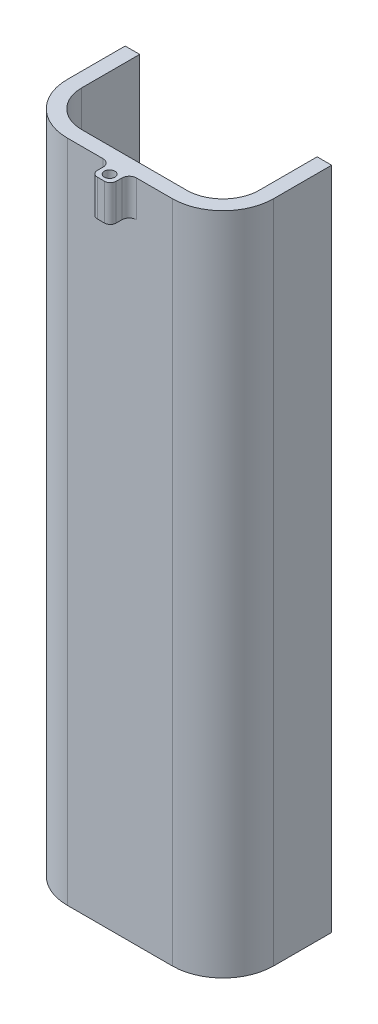
ISO-10303-21;
HEADER;
FILE_DESCRIPTION(('STEP AP214'),'2;1');
FILE_NAME('part.step','',(''),(''),'','','');
FILE_SCHEMA(('AUTOMOTIVE_DESIGN { 1 0 10303 214 1 1 1 1 }'));
ENDSEC;
DATA;
#1=APPLICATION_CONTEXT('core data for automotive mechanical design processes');
#2=APPLICATION_PROTOCOL_DEFINITION('international standard','automotive_design',2000,#1);
#3=PRODUCT_CONTEXT('',#1,'mechanical');
#4=PRODUCT('Part','Part','',(#3));
#5=PRODUCT_RELATED_PRODUCT_CATEGORY('part','',(#4));
#6=PRODUCT_DEFINITION_FORMATION('','',#4);
#7=PRODUCT_DEFINITION_CONTEXT('part definition',#1,'design');
#8=PRODUCT_DEFINITION('design','',#6,#7);
#9=PRODUCT_DEFINITION_SHAPE('','',#8);
#10=(LENGTH_UNIT() NAMED_UNIT(*) SI_UNIT(.MILLI.,.METRE.));
#11=(NAMED_UNIT(*) PLANE_ANGLE_UNIT() SI_UNIT($,.RADIAN.));
#12=(NAMED_UNIT(*) SI_UNIT($,.STERADIAN.) SOLID_ANGLE_UNIT());
#13=UNCERTAINTY_MEASURE_WITH_UNIT(LENGTH_MEASURE(1.E-05),#10,'distance_accuracy_value','');
#14=(GEOMETRIC_REPRESENTATION_CONTEXT(3) GLOBAL_UNCERTAINTY_ASSIGNED_CONTEXT((#13)) GLOBAL_UNIT_ASSIGNED_CONTEXT((#10,
#11,#12)) REPRESENTATION_CONTEXT('',''));
#15=CARTESIAN_POINT('',(0.,0.,0.));
#16=DIRECTION('',(0.,0.,1.));
#17=DIRECTION('',(1.,0.,0.));
#18=AXIS2_PLACEMENT_3D('',#15,#16,#17);
#19=CARTESIAN_POINT('',(0.,110.,228.149030702734));
#20=DIRECTION('',(0.,1.,0.));
#21=DIRECTION('',(0.,0.,1.));
#22=AXIS2_PLACEMENT_3D('',#19,#20,#21);
#23=PLANE('',#22);
#24=DIRECTION('',(1.,0.,0.));
#25=VECTOR('',#24,1.);
#26=CARTESIAN_POINT('',(0.,110.,0.));
#27=LINE('',#26,#25);
#28=CARTESIAN_POINT('',(24.5,110.,0.));
#29=VERTEX_POINT('',#28);
#30=CARTESIAN_POINT('',(28.5,110.,0.));
#31=VERTEX_POINT('',#30);
#32=EDGE_CURVE('E304',#29,#31,#27,.T.);
#33=ORIENTED_EDGE('',*,*,#32,.F.);
#34=DIRECTION('',(0.,0.,-1.));
#35=VECTOR('',#34,1.);
#36=CARTESIAN_POINT('',(24.5,110.,0.));
#37=LINE('',#36,#35);
#38=CARTESIAN_POINT('',(24.5,110.,16.));
#39=VERTEX_POINT('',#38);
#40=EDGE_CURVE('E246',#39,#29,#37,.T.);
#41=ORIENTED_EDGE('',*,*,#40,.F.);
#42=CARTESIAN_POINT('',(14.5,110.,16.));
#43=DIRECTION('',(0.,1.,0.));
#44=DIRECTION('',(0.,0.,1.));
#45=AXIS2_PLACEMENT_3D('',#42,#43,#44);
#46=CIRCLE('',#45,10.);
#47=CARTESIAN_POINT('',(14.5,110.,26.));
#48=VERTEX_POINT('',#47);
#49=EDGE_CURVE('E250',#39,#48,#46,.F.);
#50=ORIENTED_EDGE('',*,*,#49,.T.);
#51=DIRECTION('',(-1.,0.,0.));
#52=VECTOR('',#51,1.);
#53=CARTESIAN_POINT('',(0.,110.,26.));
#54=LINE('',#53,#52);
#55=CARTESIAN_POINT('',(-14.5,110.,26.));
#56=VERTEX_POINT('',#55);
#57=EDGE_CURVE('E253',#48,#56,#54,.T.);
#58=ORIENTED_EDGE('',*,*,#57,.T.);
#59=CARTESIAN_POINT('',(-14.5,110.,16.));
#60=DIRECTION('',(0.,1.,0.));
#61=DIRECTION('',(0.,0.,1.));
#62=AXIS2_PLACEMENT_3D('',#59,#60,#61);
#63=CIRCLE('',#62,10.);
#64=CARTESIAN_POINT('',(-24.5,110.,16.));
#65=VERTEX_POINT('',#64);
#66=EDGE_CURVE('E235',#56,#65,#63,.F.);
#67=ORIENTED_EDGE('',*,*,#66,.T.);
#68=DIRECTION('',(0.,0.,1.));
#69=VECTOR('',#68,1.);
#70=CARTESIAN_POINT('',(-24.5,110.,0.));
#71=LINE('',#70,#69);
#72=CARTESIAN_POINT('',(-24.5,110.,0.));
#73=VERTEX_POINT('',#72);
#74=EDGE_CURVE('E249',#73,#65,#71,.T.);
#75=ORIENTED_EDGE('',*,*,#74,.F.);
#76=CARTESIAN_POINT('',(-28.5,110.,0.));
#77=VERTEX_POINT('',#76);
#78=EDGE_CURVE('E291',#77,#73,#27,.T.);
#79=ORIENTED_EDGE('',*,*,#78,.F.);
#80=DIRECTION('',(0.,0.,-1.));
#81=VECTOR('',#80,1.);
#82=CARTESIAN_POINT('',(-28.5,110.,228.149030702734));
#83=LINE('',#82,#81);
#84=CARTESIAN_POINT('',(-28.5,110.,16.));
#85=VERTEX_POINT('',#84);
#86=EDGE_CURVE('E301',#85,#77,#83,.T.);
#87=ORIENTED_EDGE('',*,*,#86,.F.);
#88=CARTESIAN_POINT('',(-14.5,110.,16.));
#89=DIRECTION('',(0.,1.,0.));
#90=DIRECTION('',(0.,0.,1.));
#91=AXIS2_PLACEMENT_3D('',#88,#89,#90);
#92=CIRCLE('',#91,14.);
#93=CARTESIAN_POINT('',(-14.5,110.,30.));
#94=VERTEX_POINT('',#93);
#95=EDGE_CURVE('E323',#85,#94,#92,.T.);
#96=ORIENTED_EDGE('',*,*,#95,.T.);
#97=DIRECTION('',(-1.,0.,0.));
#98=VECTOR('',#97,1.);
#99=CARTESIAN_POINT('',(0.,110.,30.));
#100=LINE('',#99,#98);
#101=CARTESIAN_POINT('',(-4.6,110.,30.));
#102=VERTEX_POINT('',#101);
#103=EDGE_CURVE('E285',#102,#94,#100,.T.);
#104=ORIENTED_EDGE('',*,*,#103,.F.);
#105=CARTESIAN_POINT('',(-4.6,110.,32.));
#106=DIRECTION('',(0.,1.,0.));
#107=DIRECTION('',(0.,0.,1.));
#108=AXIS2_PLACEMENT_3D('',#105,#106,#107);
#109=CIRCLE('',#108,2.00000000000001);
#110=CARTESIAN_POINT('',(-2.6,110.,32.));
#111=VERTEX_POINT('',#110);
#112=EDGE_CURVE('E217',#111,#102,#109,.T.);
#113=ORIENTED_EDGE('',*,*,#112,.F.);
#114=DIRECTION('',(0.,0.,-1.));
#115=VECTOR('',#114,1.);
#116=CARTESIAN_POINT('',(-2.6,110.,0.));
#117=LINE('',#116,#115);
#118=CARTESIAN_POINT('',(-2.59999999999999,110.,33.6));
#119=VERTEX_POINT('',#118);
#120=EDGE_CURVE('E187',#119,#111,#117,.T.);
#121=ORIENTED_EDGE('',*,*,#120,.F.);
#122=CARTESIAN_POINT('',(-0.999999999999997,110.,33.6));
#123=DIRECTION('',(0.,1.,0.));
#124=DIRECTION('',(0.,0.,1.));
#125=AXIS2_PLACEMENT_3D('',#122,#123,#124);
#126=CIRCLE('',#125,1.6);
#127=CARTESIAN_POINT('',(-0.999999999999997,110.,35.2));
#128=VERTEX_POINT('',#127);
#129=EDGE_CURVE('E220',#119,#128,#126,.T.);
#130=ORIENTED_EDGE('',*,*,#129,.T.);
#131=DIRECTION('',(1.,0.,0.));
#132=VECTOR('',#131,1.);
#133=CARTESIAN_POINT('',(-1.22124532708767E-13,110.,35.2));
#134=LINE('',#133,#132);
#135=CARTESIAN_POINT('',(1.,110.,35.2));
#136=VERTEX_POINT('',#135);
#137=EDGE_CURVE('E223',#128,#136,#134,.T.);
#138=ORIENTED_EDGE('',*,*,#137,.T.);
#139=CARTESIAN_POINT('',(1.,110.,33.6));
#140=DIRECTION('',(0.,1.,0.));
#141=DIRECTION('',(0.,0.,1.));
#142=AXIS2_PLACEMENT_3D('',#139,#140,#141);
#143=CIRCLE('',#142,1.60000000000001);
#144=CARTESIAN_POINT('',(2.6,110.,33.6));
#145=VERTEX_POINT('',#144);
#146=EDGE_CURVE('E226',#136,#145,#143,.T.);
#147=ORIENTED_EDGE('',*,*,#146,.T.);
#148=DIRECTION('',(0.,0.,-1.));
#149=VECTOR('',#148,1.);
#150=CARTESIAN_POINT('',(2.6,110.,0.));
#151=LINE('',#150,#149);
#152=CARTESIAN_POINT('',(2.6,110.,32.));
#153=VERTEX_POINT('',#152);
#154=EDGE_CURVE('E229',#145,#153,#151,.T.);
#155=ORIENTED_EDGE('',*,*,#154,.T.);
#156=CARTESIAN_POINT('',(4.6,110.,32.));
#157=DIRECTION('',(0.,1.,0.));
#158=DIRECTION('',(0.,0.,1.));
#159=AXIS2_PLACEMENT_3D('',#156,#157,#158);
#160=CIRCLE('',#159,2.);
#161=CARTESIAN_POINT('',(4.6,110.,30.));
#162=VERTEX_POINT('',#161);
#163=EDGE_CURVE('E199',#162,#153,#160,.T.);
#164=ORIENTED_EDGE('',*,*,#163,.F.);
#165=CARTESIAN_POINT('',(14.5,110.,30.));
#166=VERTEX_POINT('',#165);
#167=EDGE_CURVE('E314',#166,#162,#100,.T.);
#168=ORIENTED_EDGE('',*,*,#167,.F.);
#169=CARTESIAN_POINT('',(14.5,110.,16.));
#170=DIRECTION('',(0.,1.,0.));
#171=DIRECTION('',(0.,0.,1.));
#172=AXIS2_PLACEMENT_3D('',#169,#170,#171);
#173=CIRCLE('',#172,14.);
#174=CARTESIAN_POINT('',(28.5,110.,16.));
#175=VERTEX_POINT('',#174);
#176=EDGE_CURVE('E326',#166,#175,#173,.T.);
#177=ORIENTED_EDGE('',*,*,#176,.T.);
#178=DIRECTION('',(0.,0.,-1.));
#179=VECTOR('',#178,1.);
#180=CARTESIAN_POINT('',(28.5,110.,228.149030702734));
#181=LINE('',#180,#179);
#182=EDGE_CURVE('E306',#175,#31,#181,.T.);
#183=ORIENTED_EDGE('',*,*,#182,.T.);
#184=EDGE_LOOP('',(#33,#41,#50,#58,#67,#75,#79,#87,#96,#104,#113,#121,#130,#138,#147,#155,#164,
#168,#177,#183));
#185=FACE_BOUND('',#184,.T.);
#186=CARTESIAN_POINT('',(0.,110.,32.8));
#187=DIRECTION('',(0.,1.,0.));
#188=DIRECTION('',(0.,0.,1.));
#189=AXIS2_PLACEMENT_3D('',#186,#187,#188);
#190=CIRCLE('',#189,1.45);
#191=CARTESIAN_POINT('',(0.,110.,34.25));
#192=VERTEX_POINT('',#191);
#193=EDGE_CURVE('E196',#192,#192,#190,.T.);
#194=ORIENTED_EDGE('',*,*,#193,.F.);
#195=EDGE_LOOP('',(#194));
#196=FACE_BOUND('',#195,.T.);
#197=ADVANCED_FACE('F35',(#185,#196),#23,.T.);
#198=CARTESIAN_POINT('',(0.,0.,0.));
#199=DIRECTION('',(0.,0.,1.));
#200=DIRECTION('',(1.,0.,0.));
#201=AXIS2_PLACEMENT_3D('',#198,#199,#200);
#202=PLANE('',#201);
#203=DIRECTION('',(0.,-1.,0.));
#204=VECTOR('',#203,1.);
#205=CARTESIAN_POINT('',(24.5,0.,0.));
#206=LINE('',#205,#204);
#207=CARTESIAN_POINT('',(24.5,-69.5,0.));
#208=VERTEX_POINT('',#207);
#209=EDGE_CURVE('E277',#29,#208,#206,.T.);
#210=ORIENTED_EDGE('',*,*,#209,.F.);
#211=ORIENTED_EDGE('',*,*,#32,.T.);
#212=DIRECTION('',(0.,-1.,0.));
#213=VECTOR('',#212,1.);
#214=CARTESIAN_POINT('',(28.5,0.,0.));
#215=LINE('',#214,#213);
#216=CARTESIAN_POINT('',(28.5,-73.5,0.));
#217=VERTEX_POINT('',#216);
#218=EDGE_CURVE('E282',#31,#217,#215,.T.);
#219=ORIENTED_EDGE('',*,*,#218,.T.);
#220=DIRECTION('',(1.,0.,0.));
#221=VECTOR('',#220,1.);
#222=CARTESIAN_POINT('',(0.,-73.5,0.));
#223=LINE('',#222,#221);
#224=CARTESIAN_POINT('',(-28.5,-73.5,0.));
#225=VERTEX_POINT('',#224);
#226=EDGE_CURVE('E292',#225,#217,#223,.T.);
#227=ORIENTED_EDGE('',*,*,#226,.F.);
#228=DIRECTION('',(0.,-1.,0.));
#229=VECTOR('',#228,1.);
#230=CARTESIAN_POINT('',(-28.5,0.,0.));
#231=LINE('',#230,#229);
#232=EDGE_CURVE('E297',#77,#225,#231,.T.);
#233=ORIENTED_EDGE('',*,*,#232,.F.);
#234=ORIENTED_EDGE('',*,*,#78,.T.);
#235=DIRECTION('',(0.,-1.,0.));
#236=VECTOR('',#235,1.);
#237=CARTESIAN_POINT('',(-24.5,0.,0.));
#238=LINE('',#237,#236);
#239=CARTESIAN_POINT('',(-24.5,-69.5,0.));
#240=VERTEX_POINT('',#239);
#241=EDGE_CURVE('E278',#73,#240,#238,.T.);
#242=ORIENTED_EDGE('',*,*,#241,.T.);
#243=DIRECTION('',(1.,0.,0.));
#244=VECTOR('',#243,1.);
#245=CARTESIAN_POINT('',(0.,-69.5,0.));
#246=LINE('',#245,#244);
#247=EDGE_CURVE('E281',#240,#208,#246,.T.);
#248=ORIENTED_EDGE('',*,*,#247,.T.);
#249=EDGE_LOOP('',(#210,#211,#219,#227,#233,#234,#242,#248));
#250=FACE_BOUND('',#249,.T.);
#251=ADVANCED_FACE('F354',(#250),#202,.F.);
#252=CARTESIAN_POINT('',(24.5,0.,228.149030702734));
#253=DIRECTION('',(1.,0.,0.));
#254=DIRECTION('',(0.,1.,0.));
#255=AXIS2_PLACEMENT_3D('',#252,#253,#254);
#256=PLANE('',#255);
#257=DIRECTION('',(0.,-1.,0.));
#258=VECTOR('',#257,1.);
#259=CARTESIAN_POINT('',(24.5,156.960769224964,16.));
#260=LINE('',#259,#258);
#261=CARTESIAN_POINT('',(24.5,-69.5,16.));
#262=VERTEX_POINT('',#261);
#263=EDGE_CURVE('E260',#39,#262,#260,.T.);
#264=ORIENTED_EDGE('',*,*,#263,.F.);
#265=ORIENTED_EDGE('',*,*,#40,.T.);
#266=ORIENTED_EDGE('',*,*,#209,.T.);
#267=DIRECTION('',(0.,0.,-1.));
#268=VECTOR('',#267,1.);
#269=CARTESIAN_POINT('',(24.5,-69.5,228.149030702734));
#270=LINE('',#269,#268);
#271=EDGE_CURVE('E288',#262,#208,#270,.T.);
#272=ORIENTED_EDGE('',*,*,#271,.F.);
#273=EDGE_LOOP('',(#264,#265,#266,#272));
#274=FACE_BOUND('',#273,.T.);
#275=ADVANCED_FACE('F359',(#274),#256,.F.);
#276=CARTESIAN_POINT('',(0.,-69.5,228.149030702734));
#277=DIRECTION('',(0.,1.,0.));
#278=DIRECTION('',(0.,0.,1.));
#279=AXIS2_PLACEMENT_3D('',#276,#277,#278);
#280=PLANE('',#279);
#281=DIRECTION('',(-1.,0.,0.));
#282=VECTOR('',#281,1.);
#283=CARTESIAN_POINT('',(0.,-69.5,26.));
#284=LINE('',#283,#282);
#285=CARTESIAN_POINT('',(14.5,-69.5,26.));
#286=VERTEX_POINT('',#285);
#287=CARTESIAN_POINT('',(-14.5,-69.5,26.));
#288=VERTEX_POINT('',#287);
#289=EDGE_CURVE('E265',#286,#288,#284,.T.);
#290=ORIENTED_EDGE('',*,*,#289,.F.);
#291=CARTESIAN_POINT('',(14.5,-69.5,16.));
#292=DIRECTION('',(0.,1.,0.));
#293=DIRECTION('',(0.,0.,1.));
#294=AXIS2_PLACEMENT_3D('',#291,#292,#293);
#295=CIRCLE('',#294,10.);
#296=EDGE_CURVE('E269',#262,#286,#295,.F.);
#297=ORIENTED_EDGE('',*,*,#296,.F.);
#298=ORIENTED_EDGE('',*,*,#271,.T.);
#299=ORIENTED_EDGE('',*,*,#247,.F.);
#300=DIRECTION('',(0.,0.,-1.));
#301=VECTOR('',#300,1.);
#302=CARTESIAN_POINT('',(-24.5,-69.5,228.149030702734));
#303=LINE('',#302,#301);
#304=CARTESIAN_POINT('',(-24.5,-69.5,16.));
#305=VERTEX_POINT('',#304);
#306=EDGE_CURVE('E307',#305,#240,#303,.T.);
#307=ORIENTED_EDGE('',*,*,#306,.F.);
#308=CARTESIAN_POINT('',(-14.5,-69.5,16.));
#309=DIRECTION('',(0.,1.,0.));
#310=DIRECTION('',(0.,0.,1.));
#311=AXIS2_PLACEMENT_3D('',#308,#309,#310);
#312=CIRCLE('',#311,10.);
#313=EDGE_CURVE('E261',#288,#305,#312,.F.);
#314=ORIENTED_EDGE('',*,*,#313,.F.);
#315=EDGE_LOOP('',(#290,#297,#298,#299,#307,#314));
#316=FACE_BOUND('',#315,.T.);
#317=ADVANCED_FACE('F402',(#316),#280,.T.);
#318=CARTESIAN_POINT('',(-24.5,0.,228.149030702734));
#319=DIRECTION('',(1.,0.,0.));
#320=DIRECTION('',(0.,1.,0.));
#321=AXIS2_PLACEMENT_3D('',#318,#319,#320);
#322=PLANE('',#321);
#323=ORIENTED_EDGE('',*,*,#241,.F.);
#324=ORIENTED_EDGE('',*,*,#74,.T.);
#325=DIRECTION('',(0.,-1.,0.));
#326=VECTOR('',#325,1.);
#327=CARTESIAN_POINT('',(-24.5,156.960769224964,16.));
#328=LINE('',#327,#326);
#329=EDGE_CURVE('E263',#65,#305,#328,.T.);
#330=ORIENTED_EDGE('',*,*,#329,.T.);
#331=ORIENTED_EDGE('',*,*,#306,.T.);
#332=EDGE_LOOP('',(#323,#324,#330,#331));
#333=FACE_BOUND('',#332,.T.);
#334=ADVANCED_FACE('F376',(#333),#322,.T.);
#335=CARTESIAN_POINT('',(-28.5,0.,228.149030702734));
#336=DIRECTION('',(1.,0.,0.));
#337=DIRECTION('',(0.,0.,-1.));
#338=AXIS2_PLACEMENT_3D('',#335,#336,#337);
#339=PLANE('',#338);
#340=DIRECTION('',(0.,0.,-1.));
#341=VECTOR('',#340,1.);
#342=CARTESIAN_POINT('',(-28.5,-73.5,228.149030702734));
#343=LINE('',#342,#341);
#344=CARTESIAN_POINT('',(-28.5,-73.5,16.));
#345=VERTEX_POINT('',#344);
#346=EDGE_CURVE('E296',#345,#225,#343,.T.);
#347=ORIENTED_EDGE('',*,*,#346,.F.);
#348=DIRECTION('',(0.,1.,0.));
#349=VECTOR('',#348,1.);
#350=CARTESIAN_POINT('',(-28.5,0.,16.));
#351=LINE('',#350,#349);
#352=EDGE_CURVE('E11',#345,#85,#351,.T.);
#353=ORIENTED_EDGE('',*,*,#352,.T.);
#354=ORIENTED_EDGE('',*,*,#86,.T.);
#355=ORIENTED_EDGE('',*,*,#232,.T.);
#356=EDGE_LOOP('',(#347,#353,#354,#355));
#357=FACE_BOUND('',#356,.T.);
#358=ADVANCED_FACE('F381',(#357),#339,.F.);
#359=CARTESIAN_POINT('',(0.,-73.5,228.149030702734));
#360=DIRECTION('',(0.,1.,0.));
#361=DIRECTION('',(-1.,0.,0.));
#362=AXIS2_PLACEMENT_3D('',#359,#360,#361);
#363=PLANE('',#362);
#364=DIRECTION('',(0.,0.,-1.));
#365=VECTOR('',#364,1.);
#366=CARTESIAN_POINT('',(28.5,-73.5,228.149030702734));
#367=LINE('',#366,#365);
#368=CARTESIAN_POINT('',(28.5,-73.5,16.));
#369=VERTEX_POINT('',#368);
#370=EDGE_CURVE('E295',#369,#217,#367,.T.);
#371=ORIENTED_EDGE('',*,*,#370,.F.);
#372=CARTESIAN_POINT('',(14.5,-73.5,16.));
#373=DIRECTION('',(0.,1.,0.));
#374=DIRECTION('',(-1.,0.,0.));
#375=AXIS2_PLACEMENT_3D('',#372,#373,#374);
#376=CIRCLE('',#375,14.);
#377=CARTESIAN_POINT('',(14.5,-73.5,30.));
#378=VERTEX_POINT('',#377);
#379=EDGE_CURVE('E43',#369,#378,#376,.F.);
#380=ORIENTED_EDGE('',*,*,#379,.T.);
#381=DIRECTION('',(-1.,0.,0.));
#382=VECTOR('',#381,1.);
#383=CARTESIAN_POINT('',(0.,-73.5,30.));
#384=LINE('',#383,#382);
#385=CARTESIAN_POINT('',(-14.5,-73.5,30.));
#386=VERTEX_POINT('',#385);
#387=EDGE_CURVE('E300',#378,#386,#384,.T.);
#388=ORIENTED_EDGE('',*,*,#387,.T.);
#389=CARTESIAN_POINT('',(-14.5,-73.5,16.));
#390=DIRECTION('',(0.,1.,0.));
#391=DIRECTION('',(-1.,0.,0.));
#392=AXIS2_PLACEMENT_3D('',#389,#390,#391);
#393=CIRCLE('',#392,14.);
#394=EDGE_CURVE('E330',#386,#345,#393,.F.);
#395=ORIENTED_EDGE('',*,*,#394,.T.);
#396=ORIENTED_EDGE('',*,*,#346,.T.);
#397=ORIENTED_EDGE('',*,*,#226,.T.);
#398=EDGE_LOOP('',(#371,#380,#388,#395,#396,#397));
#399=FACE_BOUND('',#398,.T.);
#400=ADVANCED_FACE('F335',(#399),#363,.F.);
#401=CARTESIAN_POINT('',(28.5,0.,228.149030702734));
#402=DIRECTION('',(1.,0.,0.));
#403=DIRECTION('',(0.,1.,0.));
#404=AXIS2_PLACEMENT_3D('',#401,#402,#403);
#405=PLANE('',#404);
#406=ORIENTED_EDGE('',*,*,#182,.F.);
#407=DIRECTION('',(0.,1.,0.));
#408=VECTOR('',#407,1.);
#409=CARTESIAN_POINT('',(28.5,-73.5,16.));
#410=LINE('',#409,#408);
#411=EDGE_CURVE('E328',#175,#369,#410,.F.);
#412=ORIENTED_EDGE('',*,*,#411,.T.);
#413=ORIENTED_EDGE('',*,*,#370,.T.);
#414=ORIENTED_EDGE('',*,*,#218,.F.);
#415=EDGE_LOOP('',(#406,#412,#413,#414));
#416=FACE_BOUND('',#415,.T.);
#417=ADVANCED_FACE('F351',(#416),#405,.T.);
#418=CARTESIAN_POINT('',(10.5,-67.5,30.));
#419=DIRECTION('',(0.,0.,-1.));
#420=DIRECTION('',(1.,0.,0.));
#421=AXIS2_PLACEMENT_3D('',#418,#419,#420);
#422=PLANE('',#421);
#423=DIRECTION('',(1.,0.,0.));
#424=VECTOR('',#423,1.);
#425=CARTESIAN_POINT('',(0.,100.,30.));
#426=LINE('',#425,#424);
#427=CARTESIAN_POINT('',(-4.6,100.,30.));
#428=VERTEX_POINT('',#427);
#429=CARTESIAN_POINT('',(4.6,100.,30.));
#430=VERTEX_POINT('',#429);
#431=EDGE_CURVE('E54',#428,#430,#426,.T.);
#432=ORIENTED_EDGE('',*,*,#431,.F.);
#433=DIRECTION('',(0.,1.,0.));
#434=VECTOR('',#433,1.);
#435=CARTESIAN_POINT('',(-4.6,100.,30.));
#436=LINE('',#435,#434);
#437=EDGE_CURVE('E195',#428,#102,#436,.T.);
#438=ORIENTED_EDGE('',*,*,#437,.T.);
#439=ORIENTED_EDGE('',*,*,#103,.T.);
#440=DIRECTION('',(0.,1.,0.));
#441=VECTOR('',#440,1.);
#442=CARTESIAN_POINT('',(-14.5,-67.5,30.));
#443=LINE('',#442,#441);
#444=EDGE_CURVE('E316',#94,#386,#443,.F.);
#445=ORIENTED_EDGE('',*,*,#444,.T.);
#446=ORIENTED_EDGE('',*,*,#387,.F.);
#447=DIRECTION('',(0.,1.,0.));
#448=VECTOR('',#447,1.);
#449=CARTESIAN_POINT('',(14.5,110.,30.));
#450=LINE('',#449,#448);
#451=EDGE_CURVE('E320',#378,#166,#450,.T.);
#452=ORIENTED_EDGE('',*,*,#451,.T.);
#453=ORIENTED_EDGE('',*,*,#167,.T.);
#454=DIRECTION('',(0.,1.,0.));
#455=VECTOR('',#454,1.);
#456=CARTESIAN_POINT('',(4.6,100.,30.));
#457=LINE('',#456,#455);
#458=EDGE_CURVE('E50',#430,#162,#457,.T.);
#459=ORIENTED_EDGE('',*,*,#458,.F.);
#460=EDGE_LOOP('',(#432,#438,#439,#445,#446,#452,#453,#459));
#461=FACE_BOUND('',#460,.T.);
#462=ADVANCED_FACE('F340',(#461),#422,.F.);
#463=CARTESIAN_POINT('',(14.5,156.960769224964,16.));
#464=DIRECTION('',(0.,-1.,0.));
#465=DIRECTION('',(0.,0.,-1.));
#466=AXIS2_PLACEMENT_3D('',#463,#464,#465);
#467=CYLINDRICAL_SURFACE('',#466,10.);
#468=DIRECTION('',(0.,-1.,0.));
#469=VECTOR('',#468,1.);
#470=CARTESIAN_POINT('',(14.5,156.960769224964,26.));
#471=LINE('',#470,#469);
#472=EDGE_CURVE('E268',#48,#286,#471,.T.);
#473=ORIENTED_EDGE('',*,*,#472,.F.);
#474=ORIENTED_EDGE('',*,*,#49,.F.);
#475=ORIENTED_EDGE('',*,*,#263,.T.);
#476=ORIENTED_EDGE('',*,*,#296,.T.);
#477=EDGE_LOOP('',(#473,#474,#475,#476));
#478=FACE_BOUND('',#477,.T.);
#479=ADVANCED_FACE('F363',(#478),#467,.F.);
#480=CARTESIAN_POINT('',(0.,156.960769224964,26.));
#481=DIRECTION('',(0.,0.,1.));
#482=DIRECTION('',(1.,0.,0.));
#483=AXIS2_PLACEMENT_3D('',#480,#481,#482);
#484=PLANE('',#483);
#485=DIRECTION('',(0.,-1.,0.));
#486=VECTOR('',#485,1.);
#487=CARTESIAN_POINT('',(-14.5,156.960769224964,26.));
#488=LINE('',#487,#486);
#489=EDGE_CURVE('E264',#56,#288,#488,.T.);
#490=ORIENTED_EDGE('',*,*,#489,.F.);
#491=ORIENTED_EDGE('',*,*,#57,.F.);
#492=ORIENTED_EDGE('',*,*,#472,.T.);
#493=ORIENTED_EDGE('',*,*,#289,.T.);
#494=EDGE_LOOP('',(#490,#491,#492,#493));
#495=FACE_BOUND('',#494,.T.);
#496=ADVANCED_FACE('F367',(#495),#484,.F.);
#497=CARTESIAN_POINT('',(-14.5,156.960769224964,16.));
#498=DIRECTION('',(0.,-1.,0.));
#499=DIRECTION('',(0.,0.,-1.));
#500=AXIS2_PLACEMENT_3D('',#497,#498,#499);
#501=CYLINDRICAL_SURFACE('',#500,10.);
#502=ORIENTED_EDGE('',*,*,#329,.F.);
#503=ORIENTED_EDGE('',*,*,#66,.F.);
#504=ORIENTED_EDGE('',*,*,#489,.T.);
#505=ORIENTED_EDGE('',*,*,#313,.T.);
#506=EDGE_LOOP('',(#502,#503,#504,#505));
#507=FACE_BOUND('',#506,.T.);
#508=ADVANCED_FACE('F372',(#507),#501,.F.);
#509=CARTESIAN_POINT('',(14.5,-67.5,16.));
#510=DIRECTION('',(0.,-1.,0.));
#511=DIRECTION('',(1.,0.,0.));
#512=AXIS2_PLACEMENT_3D('',#509,#510,#511);
#513=CYLINDRICAL_SURFACE('',#512,14.);
#514=ORIENTED_EDGE('',*,*,#379,.F.);
#515=ORIENTED_EDGE('',*,*,#411,.F.);
#516=ORIENTED_EDGE('',*,*,#176,.F.);
#517=ORIENTED_EDGE('',*,*,#451,.F.);
#518=EDGE_LOOP('',(#514,#515,#516,#517));
#519=FACE_BOUND('',#518,.T.);
#520=ADVANCED_FACE('F343',(#519),#513,.T.);
#521=CARTESIAN_POINT('',(-14.5,0.,16.));
#522=DIRECTION('',(0.,1.,0.));
#523=DIRECTION('',(0.,0.,1.));
#524=AXIS2_PLACEMENT_3D('',#521,#522,#523);
#525=CYLINDRICAL_SURFACE('',#524,14.);
#526=ORIENTED_EDGE('',*,*,#394,.F.);
#527=ORIENTED_EDGE('',*,*,#444,.F.);
#528=ORIENTED_EDGE('',*,*,#95,.F.);
#529=ORIENTED_EDGE('',*,*,#352,.F.);
#530=EDGE_LOOP('',(#526,#527,#528,#529));
#531=FACE_BOUND('',#530,.T.);
#532=ADVANCED_FACE('F37',(#531),#525,.T.);
#533=CARTESIAN_POINT('',(-4.6,100.,32.));
#534=DIRECTION('',(0.,1.,0.));
#535=DIRECTION('',(0.,0.,1.));
#536=AXIS2_PLACEMENT_3D('',#533,#534,#535);
#537=CYLINDRICAL_SURFACE('',#536,2.00000000000001);
#538=ORIENTED_EDGE('',*,*,#112,.T.);
#539=ORIENTED_EDGE('',*,*,#437,.F.);
#540=CARTESIAN_POINT('',(-4.6,100.,32.));
#541=DIRECTION('',(0.,1.,0.));
#542=DIRECTION('',(0.,0.,1.));
#543=AXIS2_PLACEMENT_3D('',#540,#541,#542);
#544=CIRCLE('',#543,2.00000000000001);
#545=CARTESIAN_POINT('',(-2.6,100.,32.));
#546=VERTEX_POINT('',#545);
#547=EDGE_CURVE('E176',#546,#428,#544,.T.);
#548=ORIENTED_EDGE('',*,*,#547,.F.);
#549=DIRECTION('',(0.,1.,0.));
#550=VECTOR('',#549,1.);
#551=CARTESIAN_POINT('',(-2.6,100.,32.));
#552=LINE('',#551,#550);
#553=EDGE_CURVE('E184',#546,#111,#552,.T.);
#554=ORIENTED_EDGE('',*,*,#553,.T.);
#555=EDGE_LOOP('',(#538,#539,#548,#554));
#556=FACE_BOUND('',#555,.T.);
#557=ADVANCED_FACE('F194',(#556),#537,.F.);
#558=CARTESIAN_POINT('',(4.6,100.,32.));
#559=DIRECTION('',(0.,1.,0.));
#560=DIRECTION('',(0.,0.,1.));
#561=AXIS2_PLACEMENT_3D('',#558,#559,#560);
#562=CYLINDRICAL_SURFACE('',#561,2.);
#563=ORIENTED_EDGE('',*,*,#163,.T.);
#564=DIRECTION('',(0.,1.,0.));
#565=VECTOR('',#564,1.);
#566=CARTESIAN_POINT('',(2.6,100.,32.));
#567=LINE('',#566,#565);
#568=CARTESIAN_POINT('',(2.6,100.,32.));
#569=VERTEX_POINT('',#568);
#570=EDGE_CURVE('E237',#569,#153,#567,.T.);
#571=ORIENTED_EDGE('',*,*,#570,.F.);
#572=CARTESIAN_POINT('',(4.6,100.,32.));
#573=DIRECTION('',(0.,1.,0.));
#574=DIRECTION('',(0.,0.,1.));
#575=AXIS2_PLACEMENT_3D('',#572,#573,#574);
#576=CIRCLE('',#575,2.);
#577=EDGE_CURVE('E212',#430,#569,#576,.T.);
#578=ORIENTED_EDGE('',*,*,#577,.F.);
#579=ORIENTED_EDGE('',*,*,#458,.T.);
#580=EDGE_LOOP('',(#563,#571,#578,#579));
#581=FACE_BOUND('',#580,.T.);
#582=ADVANCED_FACE('F389',(#581),#562,.F.);
#583=CARTESIAN_POINT('',(2.6,100.,0.));
#584=DIRECTION('',(1.,0.,0.));
#585=DIRECTION('',(0.,0.,-1.));
#586=AXIS2_PLACEMENT_3D('',#583,#584,#585);
#587=PLANE('',#586);
#588=ORIENTED_EDGE('',*,*,#154,.F.);
#589=DIRECTION('',(0.,1.,0.));
#590=VECTOR('',#589,1.);
#591=CARTESIAN_POINT('',(2.6,100.,33.6));
#592=LINE('',#591,#590);
#593=CARTESIAN_POINT('',(2.6,100.,33.6));
#594=VERTEX_POINT('',#593);
#595=EDGE_CURVE('E239',#594,#145,#592,.T.);
#596=ORIENTED_EDGE('',*,*,#595,.F.);
#597=DIRECTION('',(0.,0.,-1.));
#598=VECTOR('',#597,1.);
#599=CARTESIAN_POINT('',(2.6,100.,0.));
#600=LINE('',#599,#598);
#601=EDGE_CURVE('E209',#594,#569,#600,.T.);
#602=ORIENTED_EDGE('',*,*,#601,.T.);
#603=ORIENTED_EDGE('',*,*,#570,.T.);
#604=EDGE_LOOP('',(#588,#596,#602,#603));
#605=FACE_BOUND('',#604,.T.);
#606=ADVANCED_FACE('F437',(#605),#587,.T.);
#607=CARTESIAN_POINT('',(1.,100.,33.6));
#608=DIRECTION('',(0.,1.,0.));
#609=DIRECTION('',(0.,0.,1.));
#610=AXIS2_PLACEMENT_3D('',#607,#608,#609);
#611=CYLINDRICAL_SURFACE('',#610,1.60000000000001);
#612=ORIENTED_EDGE('',*,*,#146,.F.);
#613=DIRECTION('',(0.,1.,0.));
#614=VECTOR('',#613,1.);
#615=CARTESIAN_POINT('',(1.,100.,35.2));
#616=LINE('',#615,#614);
#617=CARTESIAN_POINT('',(1.,100.,35.2));
#618=VERTEX_POINT('',#617);
#619=EDGE_CURVE('E241',#618,#136,#616,.T.);
#620=ORIENTED_EDGE('',*,*,#619,.F.);
#621=CARTESIAN_POINT('',(1.,100.,33.6));
#622=DIRECTION('',(0.,1.,0.));
#623=DIRECTION('',(0.,0.,1.));
#624=AXIS2_PLACEMENT_3D('',#621,#622,#623);
#625=CIRCLE('',#624,1.60000000000001);
#626=EDGE_CURVE('E206',#618,#594,#625,.T.);
#627=ORIENTED_EDGE('',*,*,#626,.T.);
#628=ORIENTED_EDGE('',*,*,#595,.T.);
#629=EDGE_LOOP('',(#612,#620,#627,#628));
#630=FACE_BOUND('',#629,.T.);
#631=ADVANCED_FACE('F433',(#630),#611,.T.);
#632=CARTESIAN_POINT('',(-1.22124532708767E-13,100.,35.2));
#633=DIRECTION('',(0.,0.,1.));
#634=DIRECTION('',(1.,0.,0.));
#635=AXIS2_PLACEMENT_3D('',#632,#633,#634);
#636=PLANE('',#635);
#637=ORIENTED_EDGE('',*,*,#137,.F.);
#638=DIRECTION('',(0.,1.,0.));
#639=VECTOR('',#638,1.);
#640=CARTESIAN_POINT('',(-0.999999999999997,100.,35.2));
#641=LINE('',#640,#639);
#642=CARTESIAN_POINT('',(-0.999999999999997,100.,35.2));
#643=VERTEX_POINT('',#642);
#644=EDGE_CURVE('E243',#643,#128,#641,.T.);
#645=ORIENTED_EDGE('',*,*,#644,.F.);
#646=DIRECTION('',(1.,0.,0.));
#647=VECTOR('',#646,1.);
#648=CARTESIAN_POINT('',(-1.22124532708767E-13,100.,35.2));
#649=LINE('',#648,#647);
#650=EDGE_CURVE('E203',#643,#618,#649,.T.);
#651=ORIENTED_EDGE('',*,*,#650,.T.);
#652=ORIENTED_EDGE('',*,*,#619,.T.);
#653=EDGE_LOOP('',(#637,#645,#651,#652));
#654=FACE_BOUND('',#653,.T.);
#655=ADVANCED_FACE('F429',(#654),#636,.T.);
#656=CARTESIAN_POINT('',(-0.999999999999997,100.,33.6));
#657=DIRECTION('',(0.,1.,0.));
#658=DIRECTION('',(0.,0.,1.));
#659=AXIS2_PLACEMENT_3D('',#656,#657,#658);
#660=CYLINDRICAL_SURFACE('',#659,1.6);
#661=ORIENTED_EDGE('',*,*,#129,.F.);
#662=DIRECTION('',(0.,1.,0.));
#663=VECTOR('',#662,1.);
#664=CARTESIAN_POINT('',(-2.59999999999999,100.,33.6));
#665=LINE('',#664,#663);
#666=CARTESIAN_POINT('',(-2.59999999999999,100.,33.6));
#667=VERTEX_POINT('',#666);
#668=EDGE_CURVE('E191',#667,#119,#665,.T.);
#669=ORIENTED_EDGE('',*,*,#668,.F.);
#670=CARTESIAN_POINT('',(-0.999999999999997,100.,33.6));
#671=DIRECTION('',(0.,1.,0.));
#672=DIRECTION('',(0.,0.,1.));
#673=AXIS2_PLACEMENT_3D('',#670,#671,#672);
#674=CIRCLE('',#673,1.6);
#675=EDGE_CURVE('E180',#667,#643,#674,.T.);
#676=ORIENTED_EDGE('',*,*,#675,.T.);
#677=ORIENTED_EDGE('',*,*,#644,.T.);
#678=EDGE_LOOP('',(#661,#669,#676,#677));
#679=FACE_BOUND('',#678,.T.);
#680=ADVANCED_FACE('F426',(#679),#660,.T.);
#681=CARTESIAN_POINT('',(-2.6,100.,0.));
#682=DIRECTION('',(1.,0.,0.));
#683=DIRECTION('',(0.,0.,-1.));
#684=AXIS2_PLACEMENT_3D('',#681,#682,#683);
#685=PLANE('',#684);
#686=ORIENTED_EDGE('',*,*,#120,.T.);
#687=ORIENTED_EDGE('',*,*,#553,.F.);
#688=DIRECTION('',(0.,0.,-1.));
#689=VECTOR('',#688,1.);
#690=CARTESIAN_POINT('',(-2.6,100.,0.));
#691=LINE('',#690,#689);
#692=EDGE_CURVE('E171',#667,#546,#691,.T.);
#693=ORIENTED_EDGE('',*,*,#692,.F.);
#694=ORIENTED_EDGE('',*,*,#668,.T.);
#695=EDGE_LOOP('',(#686,#687,#693,#694));
#696=FACE_BOUND('',#695,.T.);
#697=ADVANCED_FACE('F185',(#696),#685,.F.);
#698=CARTESIAN_POINT('',(0.,100.,32.8));
#699=DIRECTION('',(0.,1.,0.));
#700=DIRECTION('',(0.,0.,1.));
#701=AXIS2_PLACEMENT_3D('',#698,#699,#700);
#702=CYLINDRICAL_SURFACE('',#701,1.45);
#703=CARTESIAN_POINT('',(0.,100.,32.8));
#704=DIRECTION('',(0.,1.,0.));
#705=DIRECTION('',(0.,0.,1.));
#706=AXIS2_PLACEMENT_3D('',#703,#704,#705);
#707=CIRCLE('',#706,1.45);
#708=CARTESIAN_POINT('',(0.,100.,34.25));
#709=VERTEX_POINT('',#708);
#710=EDGE_CURVE('E192',#709,#709,#707,.T.);
#711=ORIENTED_EDGE('',*,*,#710,.F.);
#712=EDGE_LOOP('',(#711));
#713=FACE_BOUND('',#712,.T.);
#714=ORIENTED_EDGE('',*,*,#193,.T.);
#715=EDGE_LOOP('',(#714));
#716=FACE_BOUND('',#715,.T.);
#717=ADVANCED_FACE('F425',(#713,#716),#702,.F.);
#718=CARTESIAN_POINT('',(0.,100.,0.));
#719=DIRECTION('',(0.,1.,0.));
#720=DIRECTION('',(0.,0.,1.));
#721=AXIS2_PLACEMENT_3D('',#718,#719,#720);
#722=PLANE('',#721);
#723=ORIENTED_EDGE('',*,*,#547,.T.);
#724=ORIENTED_EDGE('',*,*,#431,.T.);
#725=ORIENTED_EDGE('',*,*,#577,.T.);
#726=ORIENTED_EDGE('',*,*,#601,.F.);
#727=ORIENTED_EDGE('',*,*,#626,.F.);
#728=ORIENTED_EDGE('',*,*,#650,.F.);
#729=ORIENTED_EDGE('',*,*,#675,.F.);
#730=ORIENTED_EDGE('',*,*,#692,.T.);
#731=EDGE_LOOP('',(#723,#724,#725,#726,#727,#728,#729,#730));
#732=FACE_BOUND('',#731,.T.);
#733=ORIENTED_EDGE('',*,*,#710,.T.);
#734=EDGE_LOOP('',(#733));
#735=FACE_BOUND('',#734,.T.);
#736=ADVANCED_FACE('F173',(#732,#735),#722,.F.);
#737=CLOSED_SHELL('',(#197,#251,#275,#317,#334,#358,#400,#417,#462,#479,#496,#508,#520,#532,
#557,#582,#606,#631,#655,#680,#697,#717,#736));
#738=MANIFOLD_SOLID_BREP('B2',#737);
#739=ADVANCED_BREP_SHAPE_REPRESENTATION('',(#18,#738),#14);
#740=SHAPE_DEFINITION_REPRESENTATION(#9,#739);
ENDSEC;
END-ISO-10303-21;
